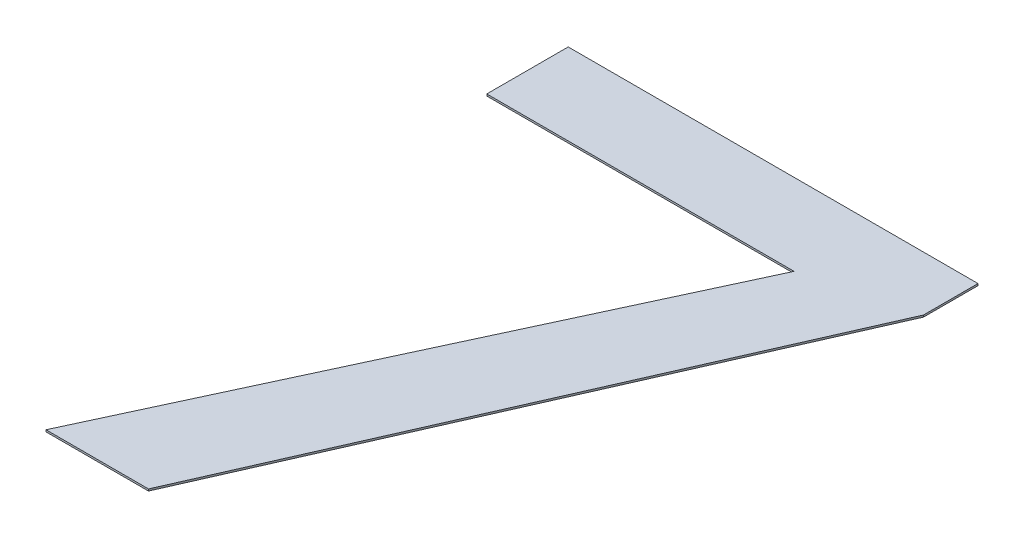
ISO-10303-21;
HEADER;
FILE_DESCRIPTION(('STEP AP214'),'2;1');
FILE_NAME('part.step','',(''),(''),'','','');
FILE_SCHEMA(('AUTOMOTIVE_DESIGN { 1 0 10303 214 1 1 1 1 }'));
ENDSEC;
DATA;
#1=APPLICATION_CONTEXT('core data for automotive mechanical design processes');
#2=APPLICATION_PROTOCOL_DEFINITION('international standard','automotive_design',2000,#1);
#3=PRODUCT_CONTEXT('',#1,'mechanical');
#4=PRODUCT('Part','Part','',(#3));
#5=PRODUCT_RELATED_PRODUCT_CATEGORY('part','',(#4));
#6=PRODUCT_DEFINITION_FORMATION('','',#4);
#7=PRODUCT_DEFINITION_CONTEXT('part definition',#1,'design');
#8=PRODUCT_DEFINITION('design','',#6,#7);
#9=PRODUCT_DEFINITION_SHAPE('','',#8);
#10=(LENGTH_UNIT() NAMED_UNIT(*) SI_UNIT(.MILLI.,.METRE.));
#11=(NAMED_UNIT(*) PLANE_ANGLE_UNIT() SI_UNIT($,.RADIAN.));
#12=(NAMED_UNIT(*) SI_UNIT($,.STERADIAN.) SOLID_ANGLE_UNIT());
#13=UNCERTAINTY_MEASURE_WITH_UNIT(LENGTH_MEASURE(1.E-05),#10,'distance_accuracy_value','');
#14=(GEOMETRIC_REPRESENTATION_CONTEXT(3) GLOBAL_UNCERTAINTY_ASSIGNED_CONTEXT((#13)) GLOBAL_UNIT_ASSIGNED_CONTEXT((#10,
#11,#12)) REPRESENTATION_CONTEXT('',''));
#15=CARTESIAN_POINT('',(0.,0.,0.));
#16=DIRECTION('',(0.,0.,1.));
#17=DIRECTION('',(1.,0.,0.));
#18=AXIS2_PLACEMENT_3D('',#15,#16,#17);
#19=CARTESIAN_POINT('',(0.,6.,0.));
#20=DIRECTION('',(0.,1.,0.));
#21=DIRECTION('',(1.,0.,0.));
#22=AXIS2_PLACEMENT_3D('',#19,#20,#21);
#23=PLANE('',#22);
#24=DIRECTION('',(0.402862344537041,0.,-0.915260581121092));
#25=VECTOR('',#24,1.);
#26=CARTESIAN_POINT('',(2.717491290831,6.,4.034042110188));
#27=LINE('',#26,#25);
#28=CARTESIAN_POINT('',(2.717491290831,6.,4.034042110188));
#29=VERTEX_POINT('',#28);
#30=CARTESIAN_POINT('',(3.986457509797,6.,1.151085252232));
#31=VERTEX_POINT('',#30);
#32=EDGE_CURVE('E116',#29,#31,#27,.T.);
#33=ORIENTED_EDGE('',*,*,#32,.F.);
#34=DIRECTION('',(1.,0.,0.));
#35=VECTOR('',#34,1.);
#36=CARTESIAN_POINT('',(2.168295116635,6.,4.034042110188));
#37=LINE('',#36,#35);
#38=CARTESIAN_POINT('',(2.168295116635,6.,4.034042110188));
#39=VERTEX_POINT('',#38);
#40=EDGE_CURVE('E26',#39,#29,#37,.T.);
#41=ORIENTED_EDGE('',*,*,#40,.F.);
#42=DIRECTION('',(-0.420387950385947,0.,0.907344461144886));
#43=VECTOR('',#42,1.);
#44=CARTESIAN_POINT('',(3.437261335601,6.,1.295168483815));
#45=LINE('',#44,#43);
#46=CARTESIAN_POINT('',(3.437261335601,6.,1.295168483815));
#47=VERTEX_POINT('',#46);
#48=EDGE_CURVE('E19',#47,#39,#45,.T.);
#49=ORIENTED_EDGE('',*,*,#48,.F.);
#50=DIRECTION('',(1.,0.,0.));
#51=VECTOR('',#50,1.);
#52=CARTESIAN_POINT('',(1.790965039305,6.,1.295168483815));
#53=LINE('',#52,#51);
#54=CARTESIAN_POINT('',(1.790965039305,6.,1.295168483815));
#55=VERTEX_POINT('',#54);
#56=EDGE_CURVE('E140',#55,#47,#53,.T.);
#57=ORIENTED_EDGE('',*,*,#56,.F.);
#58=DIRECTION('',(0.,0.,1.));
#59=VECTOR('',#58,1.);
#60=CARTESIAN_POINT('',(1.790965039305,6.,0.859042110188));
#61=LINE('',#60,#59);
#62=CARTESIAN_POINT('',(1.790965039305,6.,0.859042110188));
#63=VERTEX_POINT('',#62);
#64=EDGE_CURVE('E76',#63,#55,#61,.T.);
#65=ORIENTED_EDGE('',*,*,#64,.F.);
#66=DIRECTION('',(-1.,0.,0.));
#67=VECTOR('',#66,1.);
#68=CARTESIAN_POINT('',(3.986457509797,6.,0.859042110188));
#69=LINE('',#68,#67);
#70=CARTESIAN_POINT('',(3.986457509797,6.,0.859042110188));
#71=VERTEX_POINT('',#70);
#72=EDGE_CURVE('E68',#71,#63,#69,.T.);
#73=ORIENTED_EDGE('',*,*,#72,.F.);
#74=DIRECTION('',(0.,0.,-1.));
#75=VECTOR('',#74,1.);
#76=CARTESIAN_POINT('',(3.986457509797,6.,1.151085252232));
#77=LINE('',#76,#75);
#78=EDGE_CURVE('E72',#31,#71,#77,.T.);
#79=ORIENTED_EDGE('',*,*,#78,.F.);
#80=EDGE_LOOP('',(#33,#41,#49,#57,#65,#73,#79));
#81=FACE_BOUND('',#80,.T.);
#82=ADVANCED_FACE('F16',(#81),#23,.F.);
#83=CARTESIAN_POINT('',(0.,6.01,0.));
#84=DIRECTION('',(0.,1.,0.));
#85=DIRECTION('',(1.,0.,0.));
#86=AXIS2_PLACEMENT_3D('',#83,#84,#85);
#87=PLANE('',#86);
#88=DIRECTION('',(0.402862344537041,0.,-0.915260581121092));
#89=VECTOR('',#88,1.);
#90=CARTESIAN_POINT('',(2.717491290831,6.01,4.034042110188));
#91=LINE('',#90,#89);
#92=CARTESIAN_POINT('',(2.717491290831,6.01,4.034042110188));
#93=VERTEX_POINT('',#92);
#94=CARTESIAN_POINT('',(3.986457509797,6.01,1.151085252232));
#95=VERTEX_POINT('',#94);
#96=EDGE_CURVE('E106',#93,#95,#91,.T.);
#97=ORIENTED_EDGE('',*,*,#96,.T.);
#98=DIRECTION('',(0.,0.,-1.));
#99=VECTOR('',#98,1.);
#100=CARTESIAN_POINT('',(3.986457509797,6.01,1.151085252232));
#101=LINE('',#100,#99);
#102=CARTESIAN_POINT('',(3.986457509797,6.01,0.859042110188));
#103=VERTEX_POINT('',#102);
#104=EDGE_CURVE('E82',#95,#103,#101,.T.);
#105=ORIENTED_EDGE('',*,*,#104,.T.);
#106=DIRECTION('',(-1.,0.,0.));
#107=VECTOR('',#106,1.);
#108=CARTESIAN_POINT('',(3.986457509797,6.01,0.859042110188));
#109=LINE('',#108,#107);
#110=CARTESIAN_POINT('',(1.790965039305,6.01,0.859042110188));
#111=VERTEX_POINT('',#110);
#112=EDGE_CURVE('E88',#103,#111,#109,.T.);
#113=ORIENTED_EDGE('',*,*,#112,.T.);
#114=DIRECTION('',(0.,0.,1.));
#115=VECTOR('',#114,1.);
#116=CARTESIAN_POINT('',(1.790965039305,6.01,0.859042110188));
#117=LINE('',#116,#115);
#118=CARTESIAN_POINT('',(1.790965039305,6.01,1.295168483815));
#119=VERTEX_POINT('',#118);
#120=EDGE_CURVE('E110',#111,#119,#117,.T.);
#121=ORIENTED_EDGE('',*,*,#120,.T.);
#122=DIRECTION('',(1.,0.,0.));
#123=VECTOR('',#122,1.);
#124=CARTESIAN_POINT('',(1.790965039305,6.01,1.295168483815));
#125=LINE('',#124,#123);
#126=CARTESIAN_POINT('',(3.437261335601,6.01,1.295168483815));
#127=VERTEX_POINT('',#126);
#128=EDGE_CURVE('E139',#119,#127,#125,.T.);
#129=ORIENTED_EDGE('',*,*,#128,.T.);
#130=DIRECTION('',(-0.420387950385947,0.,0.907344461144886));
#131=VECTOR('',#130,1.);
#132=CARTESIAN_POINT('',(3.437261335601,6.01,1.295168483815));
#133=LINE('',#132,#131);
#134=CARTESIAN_POINT('',(2.168295116635,6.01,4.034042110188));
#135=VERTEX_POINT('',#134);
#136=EDGE_CURVE('E133',#127,#135,#133,.T.);
#137=ORIENTED_EDGE('',*,*,#136,.T.);
#138=DIRECTION('',(1.,0.,0.));
#139=VECTOR('',#138,1.);
#140=CARTESIAN_POINT('',(2.168295116635,6.01,4.034042110188));
#141=LINE('',#140,#139);
#142=EDGE_CURVE('E11',#135,#93,#141,.T.);
#143=ORIENTED_EDGE('',*,*,#142,.T.);
#144=EDGE_LOOP('',(#97,#105,#113,#121,#129,#137,#143));
#145=FACE_BOUND('',#144,.T.);
#146=ADVANCED_FACE('F182',(#145),#87,.T.);
#147=CARTESIAN_POINT('',(2.168295116635,6.01,4.034042110188));
#148=DIRECTION('',(0.,0.,-1.));
#149=DIRECTION('',(0.,-1.,0.));
#150=AXIS2_PLACEMENT_3D('',#147,#148,#149);
#151=PLANE('',#150);
#152=ORIENTED_EDGE('',*,*,#40,.T.);
#153=DIRECTION('',(0.,-1.,0.));
#154=VECTOR('',#153,1.);
#155=CARTESIAN_POINT('',(2.717491290831,6.01,4.034042110188));
#156=LINE('',#155,#154);
#157=EDGE_CURVE('E99',#93,#29,#156,.T.);
#158=ORIENTED_EDGE('',*,*,#157,.F.);
#159=ORIENTED_EDGE('',*,*,#142,.F.);
#160=DIRECTION('',(0.,-1.,0.));
#161=VECTOR('',#160,1.);
#162=CARTESIAN_POINT('',(2.168295116635,6.01,4.034042110188));
#163=LINE('',#162,#161);
#164=EDGE_CURVE('E135',#135,#39,#163,.T.);
#165=ORIENTED_EDGE('',*,*,#164,.T.);
#166=EDGE_LOOP('',(#152,#158,#159,#165));
#167=FACE_BOUND('',#166,.T.);
#168=ADVANCED_FACE('F185',(#167),#151,.F.);
#169=CARTESIAN_POINT('',(3.437261335601,6.01,1.295168483815));
#170=DIRECTION('',(0.907344461144886,0.,0.420387950385947));
#171=DIRECTION('',(0.,-1.,0.));
#172=AXIS2_PLACEMENT_3D('',#169,#170,#171);
#173=PLANE('',#172);
#174=ORIENTED_EDGE('',*,*,#48,.T.);
#175=ORIENTED_EDGE('',*,*,#164,.F.);
#176=ORIENTED_EDGE('',*,*,#136,.F.);
#177=DIRECTION('',(0.,-1.,0.));
#178=VECTOR('',#177,1.);
#179=CARTESIAN_POINT('',(3.437261335601,6.01,1.295168483815));
#180=LINE('',#179,#178);
#181=EDGE_CURVE('E136',#127,#47,#180,.T.);
#182=ORIENTED_EDGE('',*,*,#181,.T.);
#183=EDGE_LOOP('',(#174,#175,#176,#182));
#184=FACE_BOUND('',#183,.T.);
#185=ADVANCED_FACE('F164',(#184),#173,.F.);
#186=CARTESIAN_POINT('',(1.790965039305,6.01,1.295168483815));
#187=DIRECTION('',(0.,0.,-1.));
#188=DIRECTION('',(0.,-1.,0.));
#189=AXIS2_PLACEMENT_3D('',#186,#187,#188);
#190=PLANE('',#189);
#191=ORIENTED_EDGE('',*,*,#56,.T.);
#192=ORIENTED_EDGE('',*,*,#181,.F.);
#193=ORIENTED_EDGE('',*,*,#128,.F.);
#194=DIRECTION('',(0.,-1.,0.));
#195=VECTOR('',#194,1.);
#196=CARTESIAN_POINT('',(1.790965039305,6.01,1.295168483815));
#197=LINE('',#196,#195);
#198=EDGE_CURVE('E124',#119,#55,#197,.T.);
#199=ORIENTED_EDGE('',*,*,#198,.T.);
#200=EDGE_LOOP('',(#191,#192,#193,#199));
#201=FACE_BOUND('',#200,.T.);
#202=ADVANCED_FACE('F194',(#201),#190,.F.);
#203=CARTESIAN_POINT('',(1.790965039305,6.01,0.859042110188));
#204=DIRECTION('',(1.,0.,0.));
#205=DIRECTION('',(0.,1.,0.));
#206=AXIS2_PLACEMENT_3D('',#203,#204,#205);
#207=PLANE('',#206);
#208=ORIENTED_EDGE('',*,*,#64,.T.);
#209=ORIENTED_EDGE('',*,*,#198,.F.);
#210=ORIENTED_EDGE('',*,*,#120,.F.);
#211=DIRECTION('',(0.,-1.,0.));
#212=VECTOR('',#211,1.);
#213=CARTESIAN_POINT('',(1.790965039305,6.01,0.859042110188));
#214=LINE('',#213,#212);
#215=EDGE_CURVE('E81',#111,#63,#214,.T.);
#216=ORIENTED_EDGE('',*,*,#215,.T.);
#217=EDGE_LOOP('',(#208,#209,#210,#216));
#218=FACE_BOUND('',#217,.T.);
#219=ADVANCED_FACE('F232',(#218),#207,.F.);
#220=CARTESIAN_POINT('',(3.986457509797,6.01,0.859042110188));
#221=DIRECTION('',(0.,0.,1.));
#222=DIRECTION('',(1.,0.,0.));
#223=AXIS2_PLACEMENT_3D('',#220,#221,#222);
#224=PLANE('',#223);
#225=ORIENTED_EDGE('',*,*,#72,.T.);
#226=ORIENTED_EDGE('',*,*,#215,.F.);
#227=ORIENTED_EDGE('',*,*,#112,.F.);
#228=DIRECTION('',(0.,-1.,0.));
#229=VECTOR('',#228,1.);
#230=CARTESIAN_POINT('',(3.986457509797,6.01,0.859042110188));
#231=LINE('',#230,#229);
#232=EDGE_CURVE('E85',#103,#71,#231,.T.);
#233=ORIENTED_EDGE('',*,*,#232,.T.);
#234=EDGE_LOOP('',(#225,#226,#227,#233));
#235=FACE_BOUND('',#234,.T.);
#236=ADVANCED_FACE('F86',(#235),#224,.F.);
#237=CARTESIAN_POINT('',(3.986457509797,6.01,1.151085252232));
#238=DIRECTION('',(-1.,0.,0.));
#239=DIRECTION('',(0.,0.,1.));
#240=AXIS2_PLACEMENT_3D('',#237,#238,#239);
#241=PLANE('',#240);
#242=ORIENTED_EDGE('',*,*,#78,.T.);
#243=ORIENTED_EDGE('',*,*,#232,.F.);
#244=ORIENTED_EDGE('',*,*,#104,.F.);
#245=DIRECTION('',(0.,-1.,0.));
#246=VECTOR('',#245,1.);
#247=CARTESIAN_POINT('',(3.986457509797,6.01,1.151085252232));
#248=LINE('',#247,#246);
#249=EDGE_CURVE('E96',#95,#31,#248,.T.);
#250=ORIENTED_EDGE('',*,*,#249,.T.);
#251=EDGE_LOOP('',(#242,#243,#244,#250));
#252=FACE_BOUND('',#251,.T.);
#253=ADVANCED_FACE('F94',(#252),#241,.F.);
#254=CARTESIAN_POINT('',(2.717491290831,6.01,4.034042110188));
#255=DIRECTION('',(-0.915260581121092,0.,-0.402862344537041));
#256=DIRECTION('',(-0.402862344537041,0.,0.915260581121092));
#257=AXIS2_PLACEMENT_3D('',#254,#255,#256);
#258=PLANE('',#257);
#259=ORIENTED_EDGE('',*,*,#32,.T.);
#260=ORIENTED_EDGE('',*,*,#249,.F.);
#261=ORIENTED_EDGE('',*,*,#96,.F.);
#262=ORIENTED_EDGE('',*,*,#157,.T.);
#263=EDGE_LOOP('',(#259,#260,#261,#262));
#264=FACE_BOUND('',#263,.T.);
#265=ADVANCED_FACE('F184',(#264),#258,.F.);
#266=CLOSED_SHELL('',(#82,#146,#168,#185,#202,#219,#236,#253,#265));
#267=MANIFOLD_SOLID_BREP('B1',#266);
#268=ADVANCED_BREP_SHAPE_REPRESENTATION('',(#18,#267),#14);
#269=SHAPE_DEFINITION_REPRESENTATION(#9,#268);
ENDSEC;
END-ISO-10303-21;
